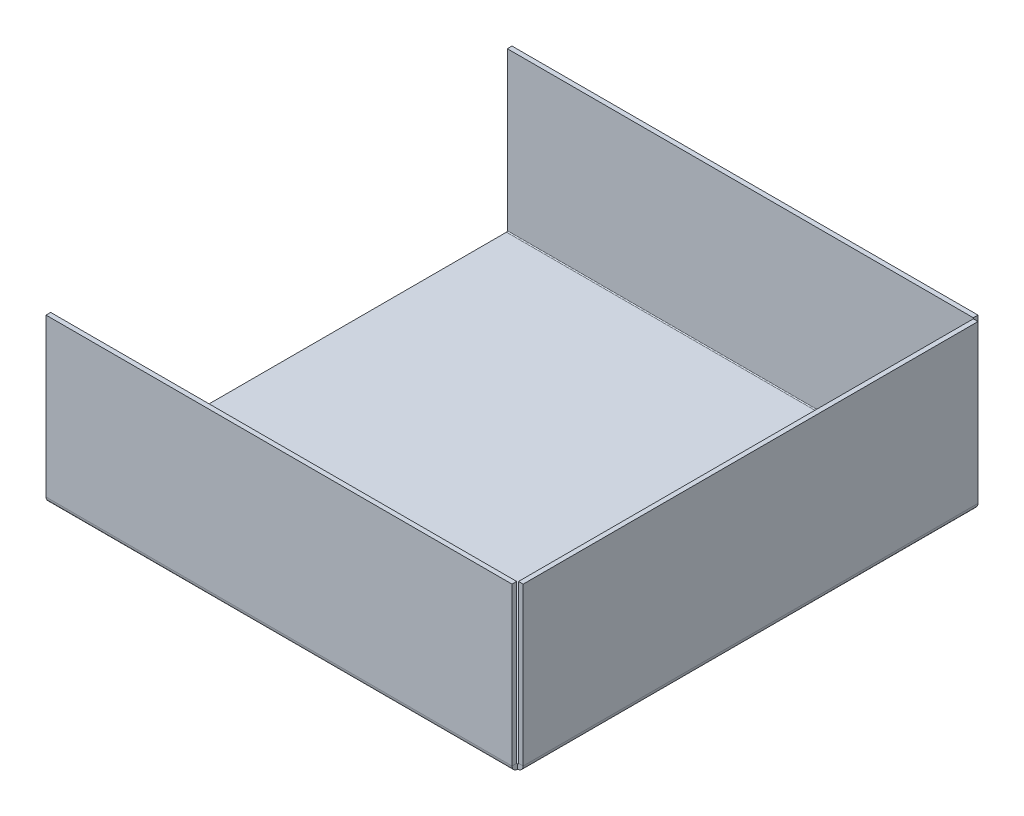
ISO-10303-21;
HEADER;
FILE_DESCRIPTION(('STEP AP214'),'2;1');
FILE_NAME('part.step','',(''),(''),'','','');
FILE_SCHEMA(('AUTOMOTIVE_DESIGN { 1 0 10303 214 1 1 1 1 }'));
ENDSEC;
DATA;
#1=APPLICATION_CONTEXT('core data for automotive mechanical design processes');
#2=APPLICATION_PROTOCOL_DEFINITION('international standard','automotive_design',2000,#1);
#3=PRODUCT_CONTEXT('',#1,'mechanical');
#4=PRODUCT('Part','Part','',(#3));
#5=PRODUCT_RELATED_PRODUCT_CATEGORY('part','',(#4));
#6=PRODUCT_DEFINITION_FORMATION('','',#4);
#7=PRODUCT_DEFINITION_CONTEXT('part definition',#1,'design');
#8=PRODUCT_DEFINITION('design','',#6,#7);
#9=PRODUCT_DEFINITION_SHAPE('','',#8);
#10=(LENGTH_UNIT() NAMED_UNIT(*) SI_UNIT(.MILLI.,.METRE.));
#11=(NAMED_UNIT(*) PLANE_ANGLE_UNIT() SI_UNIT($,.RADIAN.));
#12=(NAMED_UNIT(*) SI_UNIT($,.STERADIAN.) SOLID_ANGLE_UNIT());
#13=UNCERTAINTY_MEASURE_WITH_UNIT(LENGTH_MEASURE(1.E-05),#10,'distance_accuracy_value','');
#14=(GEOMETRIC_REPRESENTATION_CONTEXT(3) GLOBAL_UNCERTAINTY_ASSIGNED_CONTEXT((#13)) GLOBAL_UNIT_ASSIGNED_CONTEXT((#10,
#11,#12)) REPRESENTATION_CONTEXT('',''));
#15=CARTESIAN_POINT('',(0.,0.,0.));
#16=DIRECTION('',(0.,0.,1.));
#17=DIRECTION('',(1.,0.,0.));
#18=AXIS2_PLACEMENT_3D('',#15,#16,#17);
#19=CARTESIAN_POINT('',(100.,0.,-98.8));
#20=DIRECTION('',(1.,0.,0.));
#21=DIRECTION('',(0.,0.,-1.));
#22=AXIS2_PLACEMENT_3D('',#19,#20,#21);
#23=PLANE('',#22);
#24=DIRECTION('',(0.,1.,0.));
#25=VECTOR('',#24,1.);
#26=CARTESIAN_POINT('',(100.,0.,-98.8));
#27=LINE('',#26,#25);
#28=CARTESIAN_POINT('',(100.,0.,-98.8));
#29=VERTEX_POINT('',#28);
#30=CARTESIAN_POINT('',(100.,1.,-98.8));
#31=VERTEX_POINT('',#30);
#32=EDGE_CURVE('E13',#29,#31,#27,.T.);
#33=ORIENTED_EDGE('',*,*,#32,.F.);
#34=CARTESIAN_POINT('',(100.,1.2,-98.8));
#35=DIRECTION('',(1.,0.,0.));
#36=DIRECTION('',(0.,0.,-1.));
#37=AXIS2_PLACEMENT_3D('',#34,#35,#36);
#38=CIRCLE('',#37,1.2);
#39=CARTESIAN_POINT('',(100.,1.2,-100.));
#40=VERTEX_POINT('',#39);
#41=EDGE_CURVE('E177',#40,#29,#38,.F.);
#42=ORIENTED_EDGE('',*,*,#41,.F.);
#43=DIRECTION('',(0.,0.,-1.));
#44=VECTOR('',#43,1.);
#45=CARTESIAN_POINT('',(100.,1.2,-99.));
#46=LINE('',#45,#44);
#47=CARTESIAN_POINT('',(100.,1.2,-99.));
#48=VERTEX_POINT('',#47);
#49=EDGE_CURVE('E65',#48,#40,#46,.T.);
#50=ORIENTED_EDGE('',*,*,#49,.F.);
#51=CARTESIAN_POINT('',(100.,1.2,-98.8));
#52=DIRECTION('',(1.,0.,0.));
#53=DIRECTION('',(0.,0.,-1.));
#54=AXIS2_PLACEMENT_3D('',#51,#52,#53);
#55=CIRCLE('',#54,0.2);
#56=EDGE_CURVE('E170',#48,#31,#55,.F.);
#57=ORIENTED_EDGE('',*,*,#56,.T.);
#58=EDGE_LOOP('',(#33,#42,#50,#57));
#59=FACE_BOUND('',#58,.T.);
#60=ADVANCED_FACE('F57',(#59),#23,.T.);
#61=CARTESIAN_POINT('',(0.,1.2,-100.));
#62=DIRECTION('',(-1.,0.,0.));
#63=DIRECTION('',(0.,0.,1.));
#64=AXIS2_PLACEMENT_3D('',#61,#62,#63);
#65=PLANE('',#64);
#66=DIRECTION('',(0.,0.,1.));
#67=VECTOR('',#66,1.);
#68=CARTESIAN_POINT('',(0.,1.2,-100.));
#69=LINE('',#68,#67);
#70=CARTESIAN_POINT('',(0.,1.2,-100.));
#71=VERTEX_POINT('',#70);
#72=CARTESIAN_POINT('',(0.,1.2,-99.));
#73=VERTEX_POINT('',#72);
#74=EDGE_CURVE('E253',#71,#73,#69,.T.);
#75=ORIENTED_EDGE('',*,*,#74,.F.);
#76=CARTESIAN_POINT('',(0.,1.2,-98.8));
#77=DIRECTION('',(1.,0.,0.));
#78=DIRECTION('',(0.,0.,-1.));
#79=AXIS2_PLACEMENT_3D('',#76,#77,#78);
#80=CIRCLE('',#79,1.2);
#81=CARTESIAN_POINT('',(0.,0.,-98.8));
#82=VERTEX_POINT('',#81);
#83=EDGE_CURVE('E203',#71,#82,#80,.F.);
#84=ORIENTED_EDGE('',*,*,#83,.T.);
#85=DIRECTION('',(0.,-1.,0.));
#86=VECTOR('',#85,1.);
#87=CARTESIAN_POINT('',(0.,1.,-98.8));
#88=LINE('',#87,#86);
#89=CARTESIAN_POINT('',(0.,1.,-98.8));
#90=VERTEX_POINT('',#89);
#91=EDGE_CURVE('E251',#90,#82,#88,.T.);
#92=ORIENTED_EDGE('',*,*,#91,.F.);
#93=CARTESIAN_POINT('',(0.,1.2,-98.8));
#94=DIRECTION('',(1.,0.,0.));
#95=DIRECTION('',(0.,0.,-1.));
#96=AXIS2_PLACEMENT_3D('',#93,#94,#95);
#97=CIRCLE('',#96,0.2);
#98=EDGE_CURVE('E212',#73,#90,#97,.F.);
#99=ORIENTED_EDGE('',*,*,#98,.F.);
#100=EDGE_LOOP('',(#75,#84,#92,#99));
#101=FACE_BOUND('',#100,.T.);
#102=ADVANCED_FACE('F274',(#101),#65,.T.);
#103=CARTESIAN_POINT('',(0.,1.,-98.8));
#104=DIRECTION('',(-1.,0.,0.));
#105=DIRECTION('',(0.,0.,1.));
#106=AXIS2_PLACEMENT_3D('',#103,#104,#105);
#107=PLANE('',#106);
#108=DIRECTION('',(0.,-1.,0.));
#109=VECTOR('',#108,1.);
#110=CARTESIAN_POINT('',(0.,0.,-100.));
#111=LINE('',#110,#109);
#112=CARTESIAN_POINT('',(0.,35.,-100.));
#113=VERTEX_POINT('',#112);
#114=EDGE_CURVE('E206',#113,#71,#111,.T.);
#115=ORIENTED_EDGE('',*,*,#114,.T.);
#116=ORIENTED_EDGE('',*,*,#74,.T.);
#117=DIRECTION('',(0.,1.,0.));
#118=VECTOR('',#117,1.);
#119=CARTESIAN_POINT('',(0.,0.,-99.));
#120=LINE('',#119,#118);
#121=CARTESIAN_POINT('',(0.,35.,-99.));
#122=VERTEX_POINT('',#121);
#123=EDGE_CURVE('E210',#122,#73,#120,.F.);
#124=ORIENTED_EDGE('',*,*,#123,.F.);
#125=DIRECTION('',(0.,0.,-1.));
#126=VECTOR('',#125,1.);
#127=CARTESIAN_POINT('',(0.,35.,-99.));
#128=LINE('',#127,#126);
#129=EDGE_CURVE('E156',#122,#113,#128,.T.);
#130=ORIENTED_EDGE('',*,*,#129,.T.);
#131=EDGE_LOOP('',(#115,#116,#124,#130));
#132=FACE_BOUND('',#131,.T.);
#133=ADVANCED_FACE('F268',(#132),#107,.T.);
#134=CARTESIAN_POINT('',(100.,1.2,0.));
#135=DIRECTION('',(1.,0.,0.));
#136=DIRECTION('',(0.,0.,-1.));
#137=AXIS2_PLACEMENT_3D('',#134,#135,#136);
#138=PLANE('',#137);
#139=DIRECTION('',(0.,0.,-1.));
#140=VECTOR('',#139,1.);
#141=CARTESIAN_POINT('',(100.,1.2,0.));
#142=LINE('',#141,#140);
#143=CARTESIAN_POINT('',(100.,1.2,0.));
#144=VERTEX_POINT('',#143);
#145=CARTESIAN_POINT('',(100.,1.2,-1.));
#146=VERTEX_POINT('',#145);
#147=EDGE_CURVE('E73',#144,#146,#142,.T.);
#148=ORIENTED_EDGE('',*,*,#147,.F.);
#149=CARTESIAN_POINT('',(100.,1.2,-1.2));
#150=DIRECTION('',(1.,0.,0.));
#151=DIRECTION('',(0.,0.,-1.));
#152=AXIS2_PLACEMENT_3D('',#149,#150,#151);
#153=CIRCLE('',#152,1.2);
#154=CARTESIAN_POINT('',(100.,0.,-1.2));
#155=VERTEX_POINT('',#154);
#156=EDGE_CURVE('E308',#155,#144,#153,.F.);
#157=ORIENTED_EDGE('',*,*,#156,.F.);
#158=DIRECTION('',(0.,-1.,0.));
#159=VECTOR('',#158,1.);
#160=CARTESIAN_POINT('',(100.,1.,-1.2));
#161=LINE('',#160,#159);
#162=CARTESIAN_POINT('',(100.,1.,-1.20000000000001));
#163=VERTEX_POINT('',#162);
#164=EDGE_CURVE('E247',#163,#155,#161,.T.);
#165=ORIENTED_EDGE('',*,*,#164,.F.);
#166=CARTESIAN_POINT('',(100.,1.2,-1.2));
#167=DIRECTION('',(1.,0.,0.));
#168=DIRECTION('',(0.,0.,-1.));
#169=AXIS2_PLACEMENT_3D('',#166,#167,#168);
#170=CIRCLE('',#169,0.2);
#171=EDGE_CURVE('E186',#163,#146,#170,.F.);
#172=ORIENTED_EDGE('',*,*,#171,.T.);
#173=EDGE_LOOP('',(#148,#157,#165,#172));
#174=FACE_BOUND('',#173,.T.);
#175=ADVANCED_FACE('F316',(#174),#138,.T.);
#176=CARTESIAN_POINT('',(100.,1.,-1.2));
#177=DIRECTION('',(1.,0.,0.));
#178=DIRECTION('',(0.,0.,-1.));
#179=AXIS2_PLACEMENT_3D('',#176,#177,#178);
#180=PLANE('',#179);
#181=DIRECTION('',(0.,1.,0.));
#182=VECTOR('',#181,1.);
#183=CARTESIAN_POINT('',(100.,0.,0.));
#184=LINE('',#183,#182);
#185=CARTESIAN_POINT('',(100.,35.,0.));
#186=VERTEX_POINT('',#185);
#187=EDGE_CURVE('E306',#144,#186,#184,.T.);
#188=ORIENTED_EDGE('',*,*,#187,.F.);
#189=ORIENTED_EDGE('',*,*,#147,.T.);
#190=DIRECTION('',(0.,1.,0.));
#191=VECTOR('',#190,1.);
#192=CARTESIAN_POINT('',(100.,0.,-1.));
#193=LINE('',#192,#191);
#194=CARTESIAN_POINT('',(100.,35.,-1.));
#195=VERTEX_POINT('',#194);
#196=EDGE_CURVE('E128',#146,#195,#193,.T.);
#197=ORIENTED_EDGE('',*,*,#196,.T.);
#198=DIRECTION('',(0.,0.,-1.));
#199=VECTOR('',#198,1.);
#200=CARTESIAN_POINT('',(100.,35.,0.));
#201=LINE('',#200,#199);
#202=EDGE_CURVE('E304',#186,#195,#201,.T.);
#203=ORIENTED_EDGE('',*,*,#202,.F.);
#204=EDGE_LOOP('',(#188,#189,#197,#203));
#205=FACE_BOUND('',#204,.T.);
#206=ADVANCED_FACE('F320',(#205),#180,.T.);
#207=CARTESIAN_POINT('',(0.,0.,-1.2));
#208=DIRECTION('',(-1.,0.,0.));
#209=DIRECTION('',(0.,0.,1.));
#210=AXIS2_PLACEMENT_3D('',#207,#208,#209);
#211=PLANE('',#210);
#212=DIRECTION('',(0.,1.,0.));
#213=VECTOR('',#212,1.);
#214=CARTESIAN_POINT('',(0.,0.,-1.2));
#215=LINE('',#214,#213);
#216=CARTESIAN_POINT('',(0.,0.,-1.2));
#217=VERTEX_POINT('',#216);
#218=CARTESIAN_POINT('',(0.,1.,-1.2));
#219=VERTEX_POINT('',#218);
#220=EDGE_CURVE('E115',#217,#219,#215,.T.);
#221=ORIENTED_EDGE('',*,*,#220,.F.);
#222=CARTESIAN_POINT('',(0.,1.2,-1.2));
#223=DIRECTION('',(1.,0.,0.));
#224=DIRECTION('',(0.,0.,-1.));
#225=AXIS2_PLACEMENT_3D('',#222,#223,#224);
#226=CIRCLE('',#225,1.2);
#227=CARTESIAN_POINT('',(0.,1.2,0.));
#228=VERTEX_POINT('',#227);
#229=EDGE_CURVE('E199',#217,#228,#226,.F.);
#230=ORIENTED_EDGE('',*,*,#229,.T.);
#231=DIRECTION('',(0.,0.,1.));
#232=VECTOR('',#231,1.);
#233=CARTESIAN_POINT('',(0.,1.2,-1.));
#234=LINE('',#233,#232);
#235=CARTESIAN_POINT('',(0.,1.2,-1.));
#236=VERTEX_POINT('',#235);
#237=EDGE_CURVE('E122',#236,#228,#234,.T.);
#238=ORIENTED_EDGE('',*,*,#237,.F.);
#239=CARTESIAN_POINT('',(0.,1.2,-1.2));
#240=DIRECTION('',(1.,0.,0.));
#241=DIRECTION('',(0.,0.,-1.));
#242=AXIS2_PLACEMENT_3D('',#239,#240,#241);
#243=CIRCLE('',#242,0.2);
#244=EDGE_CURVE('E217',#219,#236,#243,.F.);
#245=ORIENTED_EDGE('',*,*,#244,.F.);
#246=EDGE_LOOP('',(#221,#230,#238,#245));
#247=FACE_BOUND('',#246,.T.);
#248=ADVANCED_FACE('F289',(#247),#211,.T.);
#249=CARTESIAN_POINT('',(0.,1.2,-1.));
#250=DIRECTION('',(-1.,0.,0.));
#251=DIRECTION('',(0.,0.,1.));
#252=AXIS2_PLACEMENT_3D('',#249,#250,#251);
#253=PLANE('',#252);
#254=DIRECTION('',(0.,0.,1.));
#255=VECTOR('',#254,1.);
#256=CARTESIAN_POINT('',(0.,0.,0.));
#257=LINE('',#256,#255);
#258=EDGE_CURVE('E201',#82,#217,#257,.T.);
#259=ORIENTED_EDGE('',*,*,#258,.T.);
#260=ORIENTED_EDGE('',*,*,#220,.T.);
#261=DIRECTION('',(0.,0.,-1.));
#262=VECTOR('',#261,1.);
#263=CARTESIAN_POINT('',(0.,1.,0.));
#264=LINE('',#263,#262);
#265=EDGE_CURVE('E215',#90,#219,#264,.F.);
#266=ORIENTED_EDGE('',*,*,#265,.F.);
#267=ORIENTED_EDGE('',*,*,#91,.T.);
#268=EDGE_LOOP('',(#259,#260,#266,#267));
#269=FACE_BOUND('',#268,.T.);
#270=ADVANCED_FACE('F275',(#269),#253,.T.);
#271=CARTESIAN_POINT('',(100.,0.,-1.));
#272=DIRECTION('',(0.,0.,1.));
#273=DIRECTION('',(1.,0.,0.));
#274=AXIS2_PLACEMENT_3D('',#271,#272,#273);
#275=PLANE('',#274);
#276=DIRECTION('',(0.,1.,0.));
#277=VECTOR('',#276,1.);
#278=CARTESIAN_POINT('',(0.,0.,-1.));
#279=LINE('',#278,#277);
#280=CARTESIAN_POINT('',(0.,35.,-1.));
#281=VERTEX_POINT('',#280);
#282=EDGE_CURVE('E189',#236,#281,#279,.T.);
#283=ORIENTED_EDGE('',*,*,#282,.T.);
#284=DIRECTION('',(-1.,0.,0.));
#285=VECTOR('',#284,1.);
#286=CARTESIAN_POINT('',(100.,35.,-1.));
#287=LINE('',#286,#285);
#288=EDGE_CURVE('E243',#195,#281,#287,.T.);
#289=ORIENTED_EDGE('',*,*,#288,.F.);
#290=ORIENTED_EDGE('',*,*,#196,.F.);
#291=DIRECTION('',(-1.,0.,0.));
#292=VECTOR('',#291,1.);
#293=CARTESIAN_POINT('',(100.,1.2,-1.));
#294=LINE('',#293,#292);
#295=EDGE_CURVE('E188',#146,#236,#294,.T.);
#296=ORIENTED_EDGE('',*,*,#295,.T.);
#297=EDGE_LOOP('',(#283,#289,#290,#296));
#298=FACE_BOUND('',#297,.T.);
#299=ADVANCED_FACE('F297',(#298),#275,.F.);
#300=CARTESIAN_POINT('',(100.,35.,0.));
#301=DIRECTION('',(0.,1.,0.));
#302=DIRECTION('',(0.,0.,1.));
#303=AXIS2_PLACEMENT_3D('',#300,#301,#302);
#304=PLANE('',#303);
#305=DIRECTION('',(0.,0.,-1.));
#306=VECTOR('',#305,1.);
#307=CARTESIAN_POINT('',(0.,35.,0.));
#308=LINE('',#307,#306);
#309=CARTESIAN_POINT('',(0.,35.,0.));
#310=VERTEX_POINT('',#309);
#311=EDGE_CURVE('E192',#310,#281,#308,.T.);
#312=ORIENTED_EDGE('',*,*,#311,.F.);
#313=DIRECTION('',(-1.,0.,0.));
#314=VECTOR('',#313,1.);
#315=CARTESIAN_POINT('',(100.,35.,0.));
#316=LINE('',#315,#314);
#317=EDGE_CURVE('E241',#186,#310,#316,.T.);
#318=ORIENTED_EDGE('',*,*,#317,.F.);
#319=ORIENTED_EDGE('',*,*,#202,.T.);
#320=ORIENTED_EDGE('',*,*,#288,.T.);
#321=EDGE_LOOP('',(#312,#318,#319,#320));
#322=FACE_BOUND('',#321,.T.);
#323=ADVANCED_FACE('F302',(#322),#304,.T.);
#324=CARTESIAN_POINT('',(100.,0.,0.));
#325=DIRECTION('',(0.,0.,1.));
#326=DIRECTION('',(1.,0.,0.));
#327=AXIS2_PLACEMENT_3D('',#324,#325,#326);
#328=PLANE('',#327);
#329=DIRECTION('',(0.,1.,0.));
#330=VECTOR('',#329,1.);
#331=CARTESIAN_POINT('',(0.,0.,0.));
#332=LINE('',#331,#330);
#333=EDGE_CURVE('E196',#228,#310,#332,.T.);
#334=ORIENTED_EDGE('',*,*,#333,.F.);
#335=DIRECTION('',(-1.,0.,0.));
#336=VECTOR('',#335,1.);
#337=CARTESIAN_POINT('',(100.,1.2,0.));
#338=LINE('',#337,#336);
#339=EDGE_CURVE('E238',#144,#228,#338,.T.);
#340=ORIENTED_EDGE('',*,*,#339,.F.);
#341=ORIENTED_EDGE('',*,*,#187,.T.);
#342=ORIENTED_EDGE('',*,*,#317,.T.);
#343=EDGE_LOOP('',(#334,#340,#341,#342));
#344=FACE_BOUND('',#343,.T.);
#345=ADVANCED_FACE('F319',(#344),#328,.T.);
#346=CARTESIAN_POINT('',(100.,1.2,-1.2));
#347=DIRECTION('',(-1.,0.,0.));
#348=DIRECTION('',(0.,0.,1.));
#349=AXIS2_PLACEMENT_3D('',#346,#347,#348);
#350=CYLINDRICAL_SURFACE('',#349,1.2);
#351=ORIENTED_EDGE('',*,*,#229,.F.);
#352=DIRECTION('',(-1.,0.,0.));
#353=VECTOR('',#352,1.);
#354=CARTESIAN_POINT('',(100.,0.,-1.2));
#355=LINE('',#354,#353);
#356=EDGE_CURVE('E235',#155,#217,#355,.T.);
#357=ORIENTED_EDGE('',*,*,#356,.F.);
#358=ORIENTED_EDGE('',*,*,#156,.T.);
#359=ORIENTED_EDGE('',*,*,#339,.T.);
#360=EDGE_LOOP('',(#351,#357,#358,#359));
#361=FACE_BOUND('',#360,.T.);
#362=ADVANCED_FACE('F286',(#361),#350,.T.);
#363=CARTESIAN_POINT('',(100.,0.,0.));
#364=DIRECTION('',(0.,-1.,0.));
#365=DIRECTION('',(0.,0.,-1.));
#366=AXIS2_PLACEMENT_3D('',#363,#364,#365);
#367=PLANE('',#366);
#368=ORIENTED_EDGE('',*,*,#258,.F.);
#369=DIRECTION('',(-1.,0.,0.));
#370=VECTOR('',#369,1.);
#371=CARTESIAN_POINT('',(100.,0.,-98.8));
#372=LINE('',#371,#370);
#373=EDGE_CURVE('E232',#29,#82,#372,.T.);
#374=ORIENTED_EDGE('',*,*,#373,.F.);
#375=DIRECTION('',(0.,0.,1.));
#376=VECTOR('',#375,1.);
#377=CARTESIAN_POINT('',(100.,0.,0.));
#378=LINE('',#377,#376);
#379=EDGE_CURVE('E265',#29,#155,#378,.T.);
#380=ORIENTED_EDGE('',*,*,#379,.T.);
#381=ORIENTED_EDGE('',*,*,#356,.T.);
#382=EDGE_LOOP('',(#368,#374,#380,#381));
#383=FACE_BOUND('',#382,.T.);
#384=ADVANCED_FACE('F279',(#383),#367,.T.);
#385=CARTESIAN_POINT('',(100.,1.2,-98.8));
#386=DIRECTION('',(-1.,0.,0.));
#387=DIRECTION('',(0.,0.,1.));
#388=AXIS2_PLACEMENT_3D('',#385,#386,#387);
#389=CYLINDRICAL_SURFACE('',#388,1.2);
#390=ORIENTED_EDGE('',*,*,#83,.F.);
#391=DIRECTION('',(-1.,0.,0.));
#392=VECTOR('',#391,1.);
#393=CARTESIAN_POINT('',(100.,1.2,-100.));
#394=LINE('',#393,#392);
#395=EDGE_CURVE('E229',#40,#71,#394,.T.);
#396=ORIENTED_EDGE('',*,*,#395,.F.);
#397=ORIENTED_EDGE('',*,*,#41,.T.);
#398=ORIENTED_EDGE('',*,*,#373,.T.);
#399=EDGE_LOOP('',(#390,#396,#397,#398));
#400=FACE_BOUND('',#399,.T.);
#401=ADVANCED_FACE('F260',(#400),#389,.T.);
#402=CARTESIAN_POINT('',(100.,0.,-100.));
#403=DIRECTION('',(0.,0.,-1.));
#404=DIRECTION('',(-1.,0.,0.));
#405=AXIS2_PLACEMENT_3D('',#402,#403,#404);
#406=PLANE('',#405);
#407=ORIENTED_EDGE('',*,*,#114,.F.);
#408=DIRECTION('',(-1.,0.,0.));
#409=VECTOR('',#408,1.);
#410=CARTESIAN_POINT('',(100.,35.,-100.));
#411=LINE('',#410,#409);
#412=CARTESIAN_POINT('',(100.,35.,-100.));
#413=VERTEX_POINT('',#412);
#414=EDGE_CURVE('E160',#413,#113,#411,.T.);
#415=ORIENTED_EDGE('',*,*,#414,.F.);
#416=DIRECTION('',(0.,-1.,0.));
#417=VECTOR('',#416,1.);
#418=CARTESIAN_POINT('',(100.,0.,-100.));
#419=LINE('',#418,#417);
#420=EDGE_CURVE('E175',#413,#40,#419,.T.);
#421=ORIENTED_EDGE('',*,*,#420,.T.);
#422=ORIENTED_EDGE('',*,*,#395,.T.);
#423=EDGE_LOOP('',(#407,#415,#421,#422));
#424=FACE_BOUND('',#423,.T.);
#425=ADVANCED_FACE('F266',(#424),#406,.T.);
#426=CARTESIAN_POINT('',(100.,35.,-99.));
#427=DIRECTION('',(0.,1.,0.));
#428=DIRECTION('',(0.,0.,1.));
#429=AXIS2_PLACEMENT_3D('',#426,#427,#428);
#430=PLANE('',#429);
#431=ORIENTED_EDGE('',*,*,#129,.F.);
#432=DIRECTION('',(-1.,0.,0.));
#433=VECTOR('',#432,1.);
#434=CARTESIAN_POINT('',(100.,35.,-99.));
#435=LINE('',#434,#433);
#436=CARTESIAN_POINT('',(100.,35.,-99.));
#437=VERTEX_POINT('',#436);
#438=EDGE_CURVE('E150',#437,#122,#435,.T.);
#439=ORIENTED_EDGE('',*,*,#438,.F.);
#440=DIRECTION('',(0.,0.,-1.));
#441=VECTOR('',#440,1.);
#442=CARTESIAN_POINT('',(100.,35.,-99.));
#443=LINE('',#442,#441);
#444=EDGE_CURVE('E154',#437,#413,#443,.T.);
#445=ORIENTED_EDGE('',*,*,#444,.T.);
#446=ORIENTED_EDGE('',*,*,#414,.T.);
#447=EDGE_LOOP('',(#431,#439,#445,#446));
#448=FACE_BOUND('',#447,.T.);
#449=ADVANCED_FACE('F152',(#448),#430,.T.);
#450=CARTESIAN_POINT('',(100.,0.,-99.));
#451=DIRECTION('',(0.,0.,-1.));
#452=DIRECTION('',(-1.,0.,0.));
#453=AXIS2_PLACEMENT_3D('',#450,#451,#452);
#454=PLANE('',#453);
#455=ORIENTED_EDGE('',*,*,#123,.T.);
#456=DIRECTION('',(-1.,0.,0.));
#457=VECTOR('',#456,1.);
#458=CARTESIAN_POINT('',(100.,1.2,-99.));
#459=LINE('',#458,#457);
#460=EDGE_CURVE('E161',#48,#73,#459,.T.);
#461=ORIENTED_EDGE('',*,*,#460,.F.);
#462=DIRECTION('',(0.,1.,0.));
#463=VECTOR('',#462,1.);
#464=CARTESIAN_POINT('',(100.,0.,-99.));
#465=LINE('',#464,#463);
#466=EDGE_CURVE('E165',#437,#48,#465,.F.);
#467=ORIENTED_EDGE('',*,*,#466,.F.);
#468=ORIENTED_EDGE('',*,*,#438,.T.);
#469=EDGE_LOOP('',(#455,#461,#467,#468));
#470=FACE_BOUND('',#469,.T.);
#471=ADVANCED_FACE('F166',(#470),#454,.F.);
#472=CARTESIAN_POINT('',(100.,1.2,-98.8));
#473=DIRECTION('',(-1.,0.,0.));
#474=DIRECTION('',(0.,0.,1.));
#475=AXIS2_PLACEMENT_3D('',#472,#473,#474);
#476=CYLINDRICAL_SURFACE('',#475,0.2);
#477=ORIENTED_EDGE('',*,*,#98,.T.);
#478=DIRECTION('',(-1.,0.,0.));
#479=VECTOR('',#478,1.);
#480=CARTESIAN_POINT('',(100.,1.,-98.8));
#481=LINE('',#480,#479);
#482=EDGE_CURVE('E224',#31,#90,#481,.T.);
#483=ORIENTED_EDGE('',*,*,#482,.F.);
#484=ORIENTED_EDGE('',*,*,#56,.F.);
#485=ORIENTED_EDGE('',*,*,#460,.T.);
#486=EDGE_LOOP('',(#477,#483,#484,#485));
#487=FACE_BOUND('',#486,.T.);
#488=ADVANCED_FACE('F271',(#487),#476,.F.);
#489=CARTESIAN_POINT('',(100.,1.,0.));
#490=DIRECTION('',(0.,-1.,0.));
#491=DIRECTION('',(0.,0.,-1.));
#492=AXIS2_PLACEMENT_3D('',#489,#490,#491);
#493=PLANE('',#492);
#494=ORIENTED_EDGE('',*,*,#265,.T.);
#495=DIRECTION('',(-1.,0.,0.));
#496=VECTOR('',#495,1.);
#497=CARTESIAN_POINT('',(100.,1.,-1.2));
#498=LINE('',#497,#496);
#499=EDGE_CURVE('E221',#163,#219,#498,.T.);
#500=ORIENTED_EDGE('',*,*,#499,.F.);
#501=DIRECTION('',(0.,0.,-1.));
#502=VECTOR('',#501,1.);
#503=CARTESIAN_POINT('',(100.,1.,0.));
#504=LINE('',#503,#502);
#505=EDGE_CURVE('E183',#31,#163,#504,.F.);
#506=ORIENTED_EDGE('',*,*,#505,.F.);
#507=ORIENTED_EDGE('',*,*,#482,.T.);
#508=EDGE_LOOP('',(#494,#500,#506,#507));
#509=FACE_BOUND('',#508,.T.);
#510=ADVANCED_FACE('F388',(#509),#493,.F.);
#511=CARTESIAN_POINT('',(100.,1.2,-1.2));
#512=DIRECTION('',(-1.,0.,0.));
#513=DIRECTION('',(0.,0.,1.));
#514=AXIS2_PLACEMENT_3D('',#511,#512,#513);
#515=CYLINDRICAL_SURFACE('',#514,0.2);
#516=ORIENTED_EDGE('',*,*,#244,.T.);
#517=ORIENTED_EDGE('',*,*,#295,.F.);
#518=ORIENTED_EDGE('',*,*,#171,.F.);
#519=ORIENTED_EDGE('',*,*,#499,.T.);
#520=EDGE_LOOP('',(#516,#517,#518,#519));
#521=FACE_BOUND('',#520,.T.);
#522=ADVANCED_FACE('F292',(#521),#515,.F.);
#523=CARTESIAN_POINT('',(100.,1.2,-1.2));
#524=DIRECTION('',(1.,0.,0.));
#525=DIRECTION('',(0.,0.,-1.));
#526=AXIS2_PLACEMENT_3D('',#523,#524,#525);
#527=PLANE('',#526);
#528=ORIENTED_EDGE('',*,*,#466,.T.);
#529=ORIENTED_EDGE('',*,*,#49,.T.);
#530=ORIENTED_EDGE('',*,*,#420,.F.);
#531=ORIENTED_EDGE('',*,*,#444,.F.);
#532=EDGE_LOOP('',(#528,#529,#530,#531));
#533=FACE_BOUND('',#532,.T.);
#534=ADVANCED_FACE('F173',(#533),#527,.T.);
#535=CARTESIAN_POINT('',(0.,1.2,-1.2));
#536=DIRECTION('',(1.,0.,0.));
#537=DIRECTION('',(0.,0.,-1.));
#538=AXIS2_PLACEMENT_3D('',#535,#536,#537);
#539=PLANE('',#538);
#540=ORIENTED_EDGE('',*,*,#282,.F.);
#541=ORIENTED_EDGE('',*,*,#237,.T.);
#542=ORIENTED_EDGE('',*,*,#333,.T.);
#543=ORIENTED_EDGE('',*,*,#311,.T.);
#544=EDGE_LOOP('',(#540,#541,#542,#543));
#545=FACE_BOUND('',#544,.T.);
#546=ADVANCED_FACE('F299',(#545),#539,.F.);
#547=CARTESIAN_POINT('',(100.,1.20000000000001,-1.20000000000001));
#548=DIRECTION('',(0.,0.,1.));
#549=DIRECTION('',(1.,0.,0.));
#550=AXIS2_PLACEMENT_3D('',#547,#548,#549);
#551=PLANE('',#550);
#552=DIRECTION('',(1.,0.,0.));
#553=VECTOR('',#552,1.);
#554=CARTESIAN_POINT('',(101.2,1.2,-1.2));
#555=LINE('',#554,#553);
#556=CARTESIAN_POINT('',(100.2,1.20000000000001,-1.20000000000001));
#557=VERTEX_POINT('',#556);
#558=CARTESIAN_POINT('',(101.2,1.2,-1.20000000000001));
#559=VERTEX_POINT('',#558);
#560=EDGE_CURVE('E674',#557,#559,#555,.T.);
#561=ORIENTED_EDGE('',*,*,#560,.F.);
#562=CARTESIAN_POINT('',(100.,1.20000000000001,-1.20000000000001));
#563=DIRECTION('',(0.,0.,-1.));
#564=DIRECTION('',(-1.,0.,0.));
#565=AXIS2_PLACEMENT_3D('',#562,#563,#564);
#566=CIRCLE('',#565,0.200000000000006);
#567=EDGE_CURVE('E682',#163,#557,#566,.F.);
#568=ORIENTED_EDGE('',*,*,#567,.F.);
#569=ORIENTED_EDGE('',*,*,#164,.T.);
#570=CARTESIAN_POINT('',(100.,1.20000000000001,-1.20000000000001));
#571=DIRECTION('',(0.,0.,-1.));
#572=DIRECTION('',(-1.,0.,0.));
#573=AXIS2_PLACEMENT_3D('',#570,#571,#572);
#574=CIRCLE('',#573,1.20000000000001);
#575=EDGE_CURVE('E193',#155,#559,#574,.F.);
#576=ORIENTED_EDGE('',*,*,#575,.T.);
#577=EDGE_LOOP('',(#561,#568,#569,#576));
#578=FACE_BOUND('',#577,.T.);
#579=ADVANCED_FACE('F417',(#578),#551,.T.);
#580=CARTESIAN_POINT('',(100.,1.20000000000001,-98.8));
#581=DIRECTION('',(0.,0.,1.));
#582=DIRECTION('',(1.,0.,0.));
#583=AXIS2_PLACEMENT_3D('',#580,#581,#582);
#584=PLANE('',#583);
#585=CARTESIAN_POINT('',(100.,1.20000000000001,-98.8));
#586=DIRECTION('',(0.,0.,-1.));
#587=DIRECTION('',(-1.,0.,0.));
#588=AXIS2_PLACEMENT_3D('',#585,#586,#587);
#589=CIRCLE('',#588,0.200000000000006);
#590=CARTESIAN_POINT('',(100.2,1.20000000000001,-98.8));
#591=VERTEX_POINT('',#590);
#592=EDGE_CURVE('E684',#591,#31,#589,.T.);
#593=ORIENTED_EDGE('',*,*,#592,.F.);
#594=DIRECTION('',(1.,0.,0.));
#595=VECTOR('',#594,1.);
#596=CARTESIAN_POINT('',(100.2,1.20000000000001,-98.8));
#597=LINE('',#596,#595);
#598=CARTESIAN_POINT('',(101.2,1.2,-98.8));
#599=VERTEX_POINT('',#598);
#600=EDGE_CURVE('E668',#591,#599,#597,.T.);
#601=ORIENTED_EDGE('',*,*,#600,.T.);
#602=CARTESIAN_POINT('',(100.,1.20000000000001,-98.8));
#603=DIRECTION('',(0.,0.,-1.));
#604=DIRECTION('',(-1.,0.,0.));
#605=AXIS2_PLACEMENT_3D('',#602,#603,#604);
#606=CIRCLE('',#605,1.20000000000001);
#607=EDGE_CURVE('E679',#599,#29,#606,.T.);
#608=ORIENTED_EDGE('',*,*,#607,.T.);
#609=ORIENTED_EDGE('',*,*,#32,.T.);
#610=EDGE_LOOP('',(#593,#601,#608,#609));
#611=FACE_BOUND('',#610,.T.);
#612=ADVANCED_FACE('F422',(#611),#584,.F.);
#613=CARTESIAN_POINT('',(100.,1.20000000000001,-98.8));
#614=DIRECTION('',(0.,0.,-1.));
#615=DIRECTION('',(1.,0.,0.));
#616=AXIS2_PLACEMENT_3D('',#613,#614,#615);
#617=CYLINDRICAL_SURFACE('',#616,1.20000000000001);
#618=ORIENTED_EDGE('',*,*,#379,.F.);
#619=ORIENTED_EDGE('',*,*,#607,.F.);
#620=DIRECTION('',(0.,0.,-1.));
#621=VECTOR('',#620,1.);
#622=CARTESIAN_POINT('',(101.2,1.2,0.));
#623=LINE('',#622,#621);
#624=EDGE_CURVE('E662',#559,#599,#623,.T.);
#625=ORIENTED_EDGE('',*,*,#624,.F.);
#626=ORIENTED_EDGE('',*,*,#575,.F.);
#627=EDGE_LOOP('',(#618,#619,#625,#626));
#628=FACE_BOUND('',#627,.T.);
#629=ADVANCED_FACE('F435',(#628),#617,.T.);
#630=CARTESIAN_POINT('',(100.,1.20000000000001,-98.8));
#631=DIRECTION('',(0.,0.,-1.));
#632=DIRECTION('',(1.,0.,0.));
#633=AXIS2_PLACEMENT_3D('',#630,#631,#632);
#634=CYLINDRICAL_SURFACE('',#633,0.200000000000006);
#635=ORIENTED_EDGE('',*,*,#505,.T.);
#636=ORIENTED_EDGE('',*,*,#567,.T.);
#637=DIRECTION('',(0.,0.,1.));
#638=VECTOR('',#637,1.);
#639=CARTESIAN_POINT('',(100.2,1.20000000000001,-1.2));
#640=LINE('',#639,#638);
#641=EDGE_CURVE('E671',#557,#591,#640,.F.);
#642=ORIENTED_EDGE('',*,*,#641,.T.);
#643=ORIENTED_EDGE('',*,*,#592,.T.);
#644=EDGE_LOOP('',(#635,#636,#642,#643));
#645=FACE_BOUND('',#644,.T.);
#646=ADVANCED_FACE('F446',(#645),#634,.F.);
#647=CARTESIAN_POINT('',(101.2,0.999999999999997,-98.8));
#648=DIRECTION('',(0.,0.,-1.));
#649=DIRECTION('',(-1.,0.,0.));
#650=AXIS2_PLACEMENT_3D('',#647,#648,#649);
#651=PLANE('',#650);
#652=DIRECTION('',(0.,-1.,0.));
#653=VECTOR('',#652,1.);
#654=CARTESIAN_POINT('',(101.2,0.999999999999997,-98.8));
#655=LINE('',#654,#653);
#656=CARTESIAN_POINT('',(101.2,35.,-98.8));
#657=VERTEX_POINT('',#656);
#658=EDGE_CURVE('E689',#657,#599,#655,.T.);
#659=ORIENTED_EDGE('',*,*,#658,.T.);
#660=ORIENTED_EDGE('',*,*,#600,.F.);
#661=DIRECTION('',(0.,1.,0.));
#662=VECTOR('',#661,1.);
#663=CARTESIAN_POINT('',(100.2,-3.67353206677441E-13,-98.8));
#664=LINE('',#663,#662);
#665=CARTESIAN_POINT('',(100.2,35.,-98.8));
#666=VERTEX_POINT('',#665);
#667=EDGE_CURVE('E657',#666,#591,#664,.F.);
#668=ORIENTED_EDGE('',*,*,#667,.F.);
#669=DIRECTION('',(-1.,0.,0.));
#670=VECTOR('',#669,1.);
#671=CARTESIAN_POINT('',(101.2,35.,-98.8));
#672=LINE('',#671,#670);
#673=EDGE_CURVE('E652',#657,#666,#672,.T.);
#674=ORIENTED_EDGE('',*,*,#673,.F.);
#675=EDGE_LOOP('',(#659,#660,#668,#674));
#676=FACE_BOUND('',#675,.T.);
#677=ADVANCED_FACE('F457',(#676),#651,.T.);
#678=CARTESIAN_POINT('',(101.2,35.,-1.2));
#679=DIRECTION('',(0.,0.,1.));
#680=DIRECTION('',(1.,0.,0.));
#681=AXIS2_PLACEMENT_3D('',#678,#679,#680);
#682=PLANE('',#681);
#683=DIRECTION('',(0.,-1.,0.));
#684=VECTOR('',#683,1.);
#685=CARTESIAN_POINT('',(100.2,-3.67353206677441E-13,-1.2));
#686=LINE('',#685,#684);
#687=CARTESIAN_POINT('',(100.2,35.,-1.2));
#688=VERTEX_POINT('',#687);
#689=EDGE_CURVE('E658',#557,#688,#686,.F.);
#690=ORIENTED_EDGE('',*,*,#689,.F.);
#691=ORIENTED_EDGE('',*,*,#560,.T.);
#692=DIRECTION('',(0.,1.,0.));
#693=VECTOR('',#692,1.);
#694=CARTESIAN_POINT('',(101.2,35.,-1.2));
#695=LINE('',#694,#693);
#696=CARTESIAN_POINT('',(101.2,35.,-1.2));
#697=VERTEX_POINT('',#696);
#698=EDGE_CURVE('E660',#559,#697,#695,.T.);
#699=ORIENTED_EDGE('',*,*,#698,.T.);
#700=DIRECTION('',(-1.,0.,0.));
#701=VECTOR('',#700,1.);
#702=CARTESIAN_POINT('',(101.2,35.,-1.2));
#703=LINE('',#702,#701);
#704=EDGE_CURVE('E648',#697,#688,#703,.T.);
#705=ORIENTED_EDGE('',*,*,#704,.T.);
#706=EDGE_LOOP('',(#690,#691,#699,#705));
#707=FACE_BOUND('',#706,.T.);
#708=ADVANCED_FACE('F468',(#707),#682,.T.);
#709=CARTESIAN_POINT('',(101.2,-3.70844688016285E-13,0.));
#710=DIRECTION('',(1.,0.,0.));
#711=DIRECTION('',(0.,1.,0.));
#712=AXIS2_PLACEMENT_3D('',#709,#710,#711);
#713=PLANE('',#712);
#714=ORIENTED_EDGE('',*,*,#698,.F.);
#715=ORIENTED_EDGE('',*,*,#624,.T.);
#716=ORIENTED_EDGE('',*,*,#658,.F.);
#717=DIRECTION('',(0.,0.,-1.));
#718=VECTOR('',#717,1.);
#719=CARTESIAN_POINT('',(101.2,35.,-98.8));
#720=LINE('',#719,#718);
#721=EDGE_CURVE('E694',#697,#657,#720,.T.);
#722=ORIENTED_EDGE('',*,*,#721,.F.);
#723=EDGE_LOOP('',(#714,#715,#716,#722));
#724=FACE_BOUND('',#723,.T.);
#725=ADVANCED_FACE('F479',(#724),#713,.T.);
#726=CARTESIAN_POINT('',(100.2,-3.67353206677441E-13,0.));
#727=DIRECTION('',(1.,0.,0.));
#728=DIRECTION('',(0.,1.,0.));
#729=AXIS2_PLACEMENT_3D('',#726,#727,#728);
#730=PLANE('',#729);
#731=ORIENTED_EDGE('',*,*,#641,.F.);
#732=ORIENTED_EDGE('',*,*,#689,.T.);
#733=DIRECTION('',(0.,0.,1.));
#734=VECTOR('',#733,1.);
#735=CARTESIAN_POINT('',(100.2,35.,0.));
#736=LINE('',#735,#734);
#737=EDGE_CURVE('E644',#688,#666,#736,.F.);
#738=ORIENTED_EDGE('',*,*,#737,.T.);
#739=ORIENTED_EDGE('',*,*,#667,.T.);
#740=EDGE_LOOP('',(#731,#732,#738,#739));
#741=FACE_BOUND('',#740,.T.);
#742=ADVANCED_FACE('F490',(#741),#730,.F.);
#743=CARTESIAN_POINT('',(101.2,35.,-98.8));
#744=DIRECTION('',(0.,1.,0.));
#745=DIRECTION('',(-1.,0.,0.));
#746=AXIS2_PLACEMENT_3D('',#743,#744,#745);
#747=PLANE('',#746);
#748=ORIENTED_EDGE('',*,*,#737,.F.);
#749=ORIENTED_EDGE('',*,*,#704,.F.);
#750=ORIENTED_EDGE('',*,*,#721,.T.);
#751=ORIENTED_EDGE('',*,*,#673,.T.);
#752=EDGE_LOOP('',(#748,#749,#750,#751));
#753=FACE_BOUND('',#752,.T.);
#754=ADVANCED_FACE('F501',(#753),#747,.T.);
#755=CLOSED_SHELL('',(#60,#102,#133,#175,#206,#248,#270,#299,#323,#345,#362,#384,#401,#425,#449,
#471,#488,#510,#522,#534,#546,#579,#612,#629,#646,#677,#708,#725,#742,#754));
#756=MANIFOLD_SOLID_BREP('B2',#755);
#757=ADVANCED_BREP_SHAPE_REPRESENTATION('',(#18,#756),#14);
#758=SHAPE_DEFINITION_REPRESENTATION(#9,#757);
ENDSEC;
END-ISO-10303-21;
